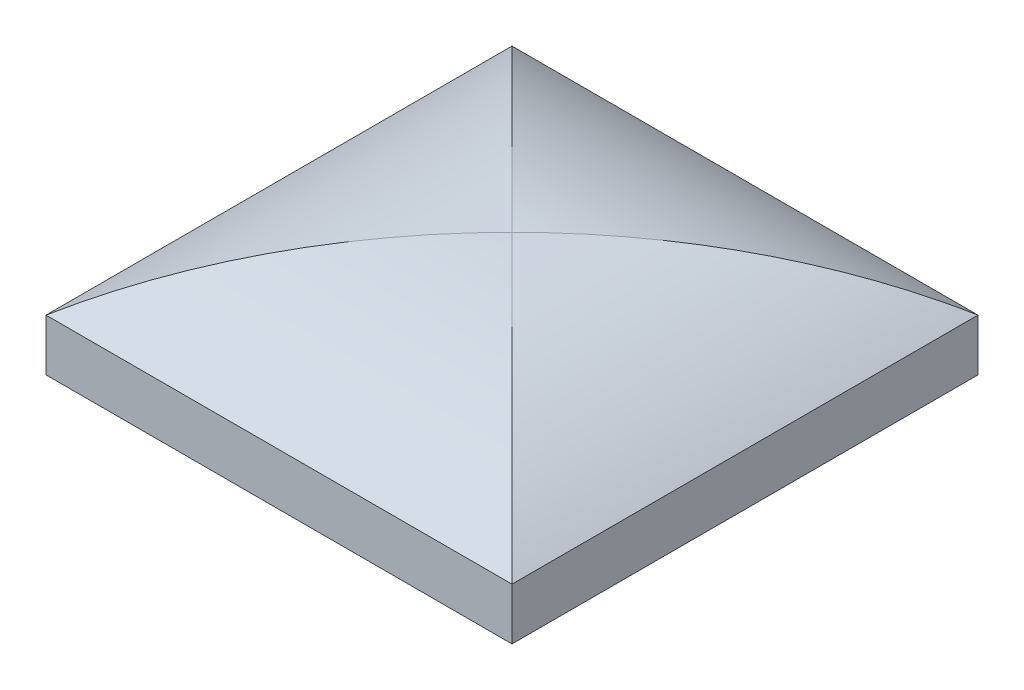
ISO-10303-21;
HEADER;
FILE_DESCRIPTION(('STEP AP214'),'2;1');
FILE_NAME('part.step','',(''),(''),'','','');
FILE_SCHEMA(('AUTOMOTIVE_DESIGN { 1 0 10303 214 1 1 1 1 }'));
ENDSEC;
DATA;
#1=APPLICATION_CONTEXT('core data for automotive mechanical design processes');
#2=APPLICATION_PROTOCOL_DEFINITION('international standard','automotive_design',2000,#1);
#3=PRODUCT_CONTEXT('',#1,'mechanical');
#4=PRODUCT('Part','Part','',(#3));
#5=PRODUCT_RELATED_PRODUCT_CATEGORY('part','',(#4));
#6=PRODUCT_DEFINITION_FORMATION('','',#4);
#7=PRODUCT_DEFINITION_CONTEXT('part definition',#1,'design');
#8=PRODUCT_DEFINITION('design','',#6,#7);
#9=PRODUCT_DEFINITION_SHAPE('','',#8);
#10=(LENGTH_UNIT() NAMED_UNIT(*) SI_UNIT(.MILLI.,.METRE.));
#11=(NAMED_UNIT(*) PLANE_ANGLE_UNIT() SI_UNIT($,.RADIAN.));
#12=(NAMED_UNIT(*) SI_UNIT($,.STERADIAN.) SOLID_ANGLE_UNIT());
#13=UNCERTAINTY_MEASURE_WITH_UNIT(LENGTH_MEASURE(1.E-05),#10,'distance_accuracy_value','');
#14=(GEOMETRIC_REPRESENTATION_CONTEXT(3) GLOBAL_UNCERTAINTY_ASSIGNED_CONTEXT((#13)) GLOBAL_UNIT_ASSIGNED_CONTEXT((#10,
#11,#12)) REPRESENTATION_CONTEXT('',''));
#15=CARTESIAN_POINT('',(0.,0.,0.));
#16=DIRECTION('',(0.,0.,1.));
#17=DIRECTION('',(1.,0.,0.));
#18=AXIS2_PLACEMENT_3D('',#15,#16,#17);
#19=CARTESIAN_POINT('',(0.,-56.1437827766148,45.));
#20=DIRECTION('',(0.,0.,-1.));
#21=DIRECTION('',(-1.,0.,0.));
#22=AXIS2_PLACEMENT_3D('',#19,#20,#21);
#23=CYLINDRICAL_SURFACE('',#22,80.);
#24=CARTESIAN_POINT('',(0.,-56.1437827766148,0.));
#25=DIRECTION('',(-0.707106781186547,0.,-0.707106781186547));
#26=DIRECTION('',(0.707106781186547,0.,-0.707106781186547));
#27=AXIS2_PLACEMENT_3D('',#24,#25,#26);
#28=ELLIPSE('',#27,113.137084989848,80.);
#29=CARTESIAN_POINT('',(0.,23.8562172233852,0.));
#30=VERTEX_POINT('',#29);
#31=CARTESIAN_POINT('',(-45.,9.99999999999999,45.));
#32=VERTEX_POINT('',#31);
#33=EDGE_CURVE('E78',#30,#32,#28,.F.);
#34=ORIENTED_EDGE('',*,*,#33,.F.);
#35=CARTESIAN_POINT('',(0.,-56.1437827766148,0.));
#36=DIRECTION('',(0.707106781186547,0.,-0.707106781186547));
#37=DIRECTION('',(-0.707106781186547,0.,-0.707106781186547));
#38=AXIS2_PLACEMENT_3D('',#35,#36,#37);
#39=ELLIPSE('',#38,113.137084989848,80.);
#40=CARTESIAN_POINT('',(-45.,10.,-45.));
#41=VERTEX_POINT('',#40);
#42=EDGE_CURVE('E102',#41,#30,#39,.T.);
#43=ORIENTED_EDGE('',*,*,#42,.F.);
#44=DIRECTION('',(0.,0.,-1.));
#45=VECTOR('',#44,1.);
#46=CARTESIAN_POINT('',(-45.,9.99999999999999,45.));
#47=LINE('',#46,#45);
#48=EDGE_CURVE('E42',#32,#41,#47,.T.);
#49=ORIENTED_EDGE('',*,*,#48,.F.);
#50=EDGE_LOOP('',(#34,#43,#49));
#51=FACE_BOUND('',#50,.T.);
#52=ADVANCED_FACE('F38',(#51),#23,.T.);
#53=CARTESIAN_POINT('',(0.,-56.1437827766148,0.));
#54=DIRECTION('',(-0.707106781186547,0.,-0.707106781186547));
#55=DIRECTION('',(0.707106781186547,0.,-0.707106781186547));
#56=AXIS2_PLACEMENT_3D('',#53,#54,#55);
#57=ELLIPSE('',#56,113.137084989848,80.);
#58=CARTESIAN_POINT('',(45.,10.,-45.));
#59=VERTEX_POINT('',#58);
#60=EDGE_CURVE('E100',#30,#59,#57,.T.);
#61=ORIENTED_EDGE('',*,*,#60,.F.);
#62=CARTESIAN_POINT('',(0.,-56.1437827766148,0.));
#63=DIRECTION('',(0.707106781186547,0.,-0.707106781186547));
#64=DIRECTION('',(-0.707106781186547,0.,-0.707106781186547));
#65=AXIS2_PLACEMENT_3D('',#62,#63,#64);
#66=ELLIPSE('',#65,113.137084989848,80.);
#67=CARTESIAN_POINT('',(45.,10.,45.));
#68=VERTEX_POINT('',#67);
#69=EDGE_CURVE('E55',#68,#30,#66,.F.);
#70=ORIENTED_EDGE('',*,*,#69,.F.);
#71=DIRECTION('',(0.,0.,-1.));
#72=VECTOR('',#71,1.);
#73=CARTESIAN_POINT('',(45.,10.,45.));
#74=LINE('',#73,#72);
#75=EDGE_CURVE('E97',#68,#59,#74,.T.);
#76=ORIENTED_EDGE('',*,*,#75,.T.);
#77=EDGE_LOOP('',(#61,#70,#76));
#78=FACE_BOUND('',#77,.T.);
#79=ADVANCED_FACE('F95',(#78),#23,.T.);
#80=CARTESIAN_POINT('',(0.,-56.1437827766148,45.));
#81=DIRECTION('',(0.,0.,-1.));
#82=DIRECTION('',(-1.,0.,0.));
#83=AXIS2_PLACEMENT_3D('',#80,#81,#82);
#84=PLANE('',#83);
#85=DIRECTION('',(0.,1.,0.));
#86=VECTOR('',#85,1.);
#87=CARTESIAN_POINT('',(45.,0.,45.));
#88=LINE('',#87,#86);
#89=CARTESIAN_POINT('',(45.,0.,45.));
#90=VERTEX_POINT('',#89);
#91=EDGE_CURVE('E105',#90,#68,#88,.T.);
#92=ORIENTED_EDGE('',*,*,#91,.T.);
#93=DIRECTION('',(-1.,0.,0.));
#94=VECTOR('',#93,1.);
#95=CARTESIAN_POINT('',(45.,10.,45.));
#96=LINE('',#95,#94);
#97=EDGE_CURVE('E84',#68,#32,#96,.T.);
#98=ORIENTED_EDGE('',*,*,#97,.T.);
#99=DIRECTION('',(0.,1.,0.));
#100=VECTOR('',#99,1.);
#101=CARTESIAN_POINT('',(-45.,0.,45.));
#102=LINE('',#101,#100);
#103=CARTESIAN_POINT('',(-45.,0.,45.));
#104=VERTEX_POINT('',#103);
#105=EDGE_CURVE('E111',#104,#32,#102,.T.);
#106=ORIENTED_EDGE('',*,*,#105,.F.);
#107=DIRECTION('',(1.,0.,0.));
#108=VECTOR('',#107,1.);
#109=CARTESIAN_POINT('',(-45.,0.,45.));
#110=LINE('',#109,#108);
#111=EDGE_CURVE('E107',#104,#90,#110,.T.);
#112=ORIENTED_EDGE('',*,*,#111,.T.);
#113=EDGE_LOOP('',(#92,#98,#106,#112));
#114=FACE_BOUND('',#113,.T.);
#115=ADVANCED_FACE('F106',(#114),#84,.F.);
#116=CARTESIAN_POINT('',(0.,-56.1437827766148,-45.));
#117=DIRECTION('',(0.,0.,-1.));
#118=DIRECTION('',(-1.,0.,0.));
#119=AXIS2_PLACEMENT_3D('',#116,#117,#118);
#120=PLANE('',#119);
#121=DIRECTION('',(-1.,0.,0.));
#122=VECTOR('',#121,1.);
#123=CARTESIAN_POINT('',(45.,10.,-45.));
#124=LINE('',#123,#122);
#125=EDGE_CURVE('E90',#59,#41,#124,.T.);
#126=ORIENTED_EDGE('',*,*,#125,.F.);
#127=DIRECTION('',(0.,1.,0.));
#128=VECTOR('',#127,1.);
#129=CARTESIAN_POINT('',(45.,0.,-45.));
#130=LINE('',#129,#128);
#131=CARTESIAN_POINT('',(45.,0.,-45.));
#132=VERTEX_POINT('',#131);
#133=EDGE_CURVE('E115',#132,#59,#130,.T.);
#134=ORIENTED_EDGE('',*,*,#133,.F.);
#135=DIRECTION('',(1.,0.,0.));
#136=VECTOR('',#135,1.);
#137=CARTESIAN_POINT('',(-45.,0.,-45.));
#138=LINE('',#137,#136);
#139=CARTESIAN_POINT('',(-45.,0.,-45.));
#140=VERTEX_POINT('',#139);
#141=EDGE_CURVE('E119',#140,#132,#138,.T.);
#142=ORIENTED_EDGE('',*,*,#141,.F.);
#143=DIRECTION('',(0.,1.,0.));
#144=VECTOR('',#143,1.);
#145=CARTESIAN_POINT('',(-45.,0.,-45.));
#146=LINE('',#145,#144);
#147=EDGE_CURVE('E122',#140,#41,#146,.T.);
#148=ORIENTED_EDGE('',*,*,#147,.T.);
#149=EDGE_LOOP('',(#126,#134,#142,#148));
#150=FACE_BOUND('',#149,.T.);
#151=ADVANCED_FACE('F134',(#150),#120,.T.);
#152=CARTESIAN_POINT('',(-45.,0.,45.));
#153=DIRECTION('',(-1.,0.,0.));
#154=DIRECTION('',(0.,0.,1.));
#155=AXIS2_PLACEMENT_3D('',#152,#153,#154);
#156=PLANE('',#155);
#157=ORIENTED_EDGE('',*,*,#147,.F.);
#158=DIRECTION('',(0.,0.,-1.));
#159=VECTOR('',#158,1.);
#160=CARTESIAN_POINT('',(-45.,0.,45.));
#161=LINE('',#160,#159);
#162=EDGE_CURVE('E11',#104,#140,#161,.T.);
#163=ORIENTED_EDGE('',*,*,#162,.F.);
#164=ORIENTED_EDGE('',*,*,#105,.T.);
#165=ORIENTED_EDGE('',*,*,#48,.T.);
#166=EDGE_LOOP('',(#157,#163,#164,#165));
#167=FACE_BOUND('',#166,.T.);
#168=ADVANCED_FACE('F40',(#167),#156,.T.);
#169=CARTESIAN_POINT('',(-45.,0.,45.));
#170=DIRECTION('',(0.,1.,0.));
#171=DIRECTION('',(-1.,0.,0.));
#172=AXIS2_PLACEMENT_3D('',#169,#170,#171);
#173=PLANE('',#172);
#174=ORIENTED_EDGE('',*,*,#141,.T.);
#175=DIRECTION('',(0.,0.,-1.));
#176=VECTOR('',#175,1.);
#177=CARTESIAN_POINT('',(45.,0.,45.));
#178=LINE('',#177,#176);
#179=EDGE_CURVE('E47',#90,#132,#178,.T.);
#180=ORIENTED_EDGE('',*,*,#179,.F.);
#181=ORIENTED_EDGE('',*,*,#111,.F.);
#182=ORIENTED_EDGE('',*,*,#162,.T.);
#183=EDGE_LOOP('',(#174,#180,#181,#182));
#184=FACE_BOUND('',#183,.T.);
#185=ADVANCED_FACE('F143',(#184),#173,.F.);
#186=CARTESIAN_POINT('',(45.,0.,45.));
#187=DIRECTION('',(-1.,0.,0.));
#188=DIRECTION('',(0.,0.,1.));
#189=AXIS2_PLACEMENT_3D('',#186,#187,#188);
#190=PLANE('',#189);
#191=ORIENTED_EDGE('',*,*,#133,.T.);
#192=ORIENTED_EDGE('',*,*,#75,.F.);
#193=ORIENTED_EDGE('',*,*,#91,.F.);
#194=ORIENTED_EDGE('',*,*,#179,.T.);
#195=EDGE_LOOP('',(#191,#192,#193,#194));
#196=FACE_BOUND('',#195,.T.);
#197=ADVANCED_FACE('F113',(#196),#190,.F.);
#198=CARTESIAN_POINT('',(45.,-56.1437827766148,0.));
#199=DIRECTION('',(-1.,0.,0.));
#200=DIRECTION('',(0.,0.,1.));
#201=AXIS2_PLACEMENT_3D('',#198,#199,#200);
#202=CYLINDRICAL_SURFACE('',#201,80.);
#203=ORIENTED_EDGE('',*,*,#42,.T.);
#204=ORIENTED_EDGE('',*,*,#60,.T.);
#205=ORIENTED_EDGE('',*,*,#125,.T.);
#206=EDGE_LOOP('',(#203,#204,#205));
#207=FACE_BOUND('',#206,.T.);
#208=ADVANCED_FACE('F131',(#207),#202,.T.);
#209=ORIENTED_EDGE('',*,*,#69,.T.);
#210=ORIENTED_EDGE('',*,*,#33,.T.);
#211=ORIENTED_EDGE('',*,*,#97,.F.);
#212=EDGE_LOOP('',(#209,#210,#211));
#213=FACE_BOUND('',#212,.T.);
#214=ADVANCED_FACE('F85',(#213),#202,.T.);
#215=CLOSED_SHELL('',(#52,#79,#115,#151,#168,#185,#197,#208,#214));
#216=MANIFOLD_SOLID_BREP('B2',#215);
#217=ADVANCED_BREP_SHAPE_REPRESENTATION('',(#18,#216),#14);
#218=SHAPE_DEFINITION_REPRESENTATION(#9,#217);
ENDSEC;
END-ISO-10303-21;
